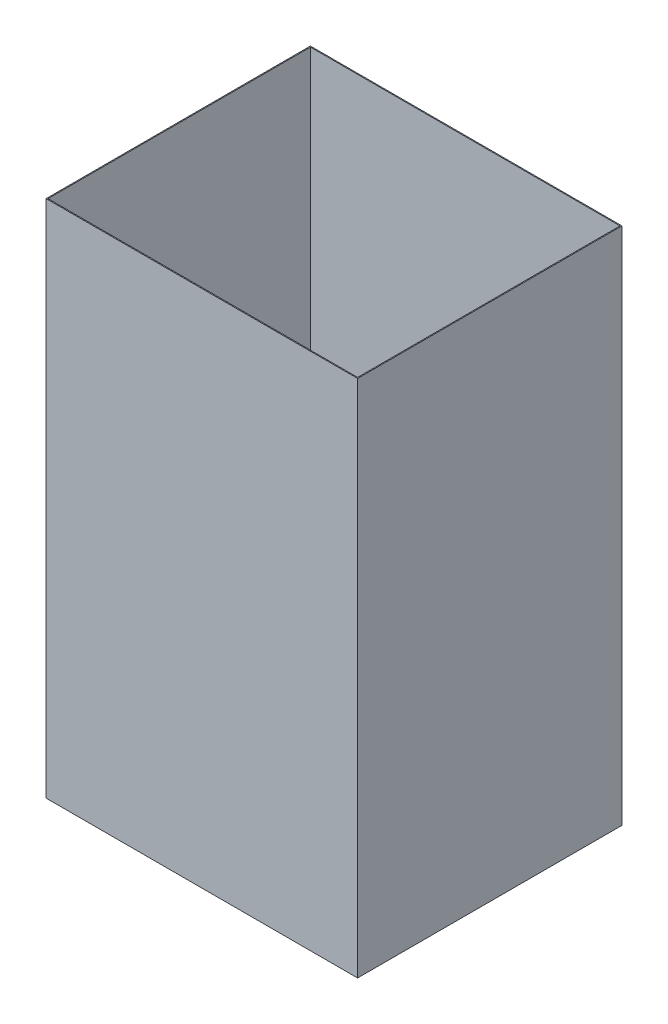
ISO-10303-21;
HEADER;
FILE_DESCRIPTION(('STEP AP214'),'2;1');
FILE_NAME('part.step','',(''),(''),'','','');
FILE_SCHEMA(('AUTOMOTIVE_DESIGN { 1 0 10303 214 1 1 1 1 }'));
ENDSEC;
DATA;
#1=APPLICATION_CONTEXT('core data for automotive mechanical design processes');
#2=APPLICATION_PROTOCOL_DEFINITION('international standard','automotive_design',2000,#1);
#3=PRODUCT_CONTEXT('',#1,'mechanical');
#4=PRODUCT('Part','Part','',(#3));
#5=PRODUCT_RELATED_PRODUCT_CATEGORY('part','',(#4));
#6=PRODUCT_DEFINITION_FORMATION('','',#4);
#7=PRODUCT_DEFINITION_CONTEXT('part definition',#1,'design');
#8=PRODUCT_DEFINITION('design','',#6,#7);
#9=PRODUCT_DEFINITION_SHAPE('','',#8);
#10=(LENGTH_UNIT() NAMED_UNIT(*) SI_UNIT(.MILLI.,.METRE.));
#11=(NAMED_UNIT(*) PLANE_ANGLE_UNIT() SI_UNIT($,.RADIAN.));
#12=(NAMED_UNIT(*) SI_UNIT($,.STERADIAN.) SOLID_ANGLE_UNIT());
#13=UNCERTAINTY_MEASURE_WITH_UNIT(LENGTH_MEASURE(1.E-05),#10,'distance_accuracy_value','');
#14=(GEOMETRIC_REPRESENTATION_CONTEXT(3) GLOBAL_UNCERTAINTY_ASSIGNED_CONTEXT((#13)) GLOBAL_UNIT_ASSIGNED_CONTEXT((#10,
#11,#12)) REPRESENTATION_CONTEXT('',''));
#15=CARTESIAN_POINT('',(0.,0.,0.));
#16=DIRECTION('',(0.,0.,1.));
#17=DIRECTION('',(1.,0.,0.));
#18=AXIS2_PLACEMENT_3D('',#15,#16,#17);
#19=CARTESIAN_POINT('',(0.,0.,0.));
#20=DIRECTION('',(0.,-1.,0.));
#21=DIRECTION('',(0.,0.,-1.));
#22=AXIS2_PLACEMENT_3D('',#19,#20,#21);
#23=PLANE('',#22);
#24=DIRECTION('',(0.,0.,1.));
#25=VECTOR('',#24,1.);
#26=CARTESIAN_POINT('',(0.,0.,0.));
#27=LINE('',#26,#25);
#28=CARTESIAN_POINT('',(0.,0.,-711.2));
#29=VERTEX_POINT('',#28);
#30=CARTESIAN_POINT('',(0.,0.,0.));
#31=VERTEX_POINT('',#30);
#32=EDGE_CURVE('E106',#29,#31,#27,.T.);
#33=ORIENTED_EDGE('',*,*,#32,.F.);
#34=DIRECTION('',(-1.,0.,0.));
#35=VECTOR('',#34,1.);
#36=CARTESIAN_POINT('',(0.,0.,-711.2));
#37=LINE('',#36,#35);
#38=CARTESIAN_POINT('',(838.2,0.,-711.2));
#39=VERTEX_POINT('',#38);
#40=EDGE_CURVE('E139',#39,#29,#37,.T.);
#41=ORIENTED_EDGE('',*,*,#40,.F.);
#42=DIRECTION('',(0.,0.,-1.));
#43=VECTOR('',#42,1.);
#44=CARTESIAN_POINT('',(838.2,0.,0.));
#45=LINE('',#44,#43);
#46=CARTESIAN_POINT('',(838.2,0.,0.));
#47=VERTEX_POINT('',#46);
#48=EDGE_CURVE('E150',#47,#39,#45,.T.);
#49=ORIENTED_EDGE('',*,*,#48,.F.);
#50=DIRECTION('',(1.,0.,0.));
#51=VECTOR('',#50,1.);
#52=CARTESIAN_POINT('',(0.,0.,0.));
#53=LINE('',#52,#51);
#54=EDGE_CURVE('E148',#31,#47,#53,.T.);
#55=ORIENTED_EDGE('',*,*,#54,.F.);
#56=EDGE_LOOP('',(#33,#41,#49,#55));
#57=FACE_BOUND('',#56,.T.);
#58=DIRECTION('',(-1.,0.,0.));
#59=VECTOR('',#58,1.);
#60=CARTESIAN_POINT('',(0.,0.,-708.66));
#61=LINE('',#60,#59);
#62=CARTESIAN_POINT('',(835.66,0.,-708.66));
#63=VERTEX_POINT('',#62);
#64=CARTESIAN_POINT('',(2.54,0.,-708.66));
#65=VERTEX_POINT('',#64);
#66=EDGE_CURVE('E127',#63,#65,#61,.T.);
#67=ORIENTED_EDGE('',*,*,#66,.T.);
#68=DIRECTION('',(0.,0.,1.));
#69=VECTOR('',#68,1.);
#70=CARTESIAN_POINT('',(2.54,0.,0.));
#71=LINE('',#70,#69);
#72=CARTESIAN_POINT('',(2.54,0.,-2.54));
#73=VERTEX_POINT('',#72);
#74=EDGE_CURVE('E114',#65,#73,#71,.T.);
#75=ORIENTED_EDGE('',*,*,#74,.T.);
#76=DIRECTION('',(1.,0.,0.));
#77=VECTOR('',#76,1.);
#78=CARTESIAN_POINT('',(0.,0.,-2.54));
#79=LINE('',#78,#77);
#80=CARTESIAN_POINT('',(835.66,0.,-2.54));
#81=VERTEX_POINT('',#80);
#82=EDGE_CURVE('E104',#73,#81,#79,.T.);
#83=ORIENTED_EDGE('',*,*,#82,.T.);
#84=DIRECTION('',(0.,0.,-1.));
#85=VECTOR('',#84,1.);
#86=CARTESIAN_POINT('',(835.66,0.,0.));
#87=LINE('',#86,#85);
#88=EDGE_CURVE('E55',#81,#63,#87,.T.);
#89=ORIENTED_EDGE('',*,*,#88,.T.);
#90=EDGE_LOOP('',(#67,#75,#83,#89));
#91=FACE_BOUND('',#90,.T.);
#92=ADVANCED_FACE('F32',(#57,#91),#23,.T.);
#93=CARTESIAN_POINT('',(0.,1397.,0.));
#94=DIRECTION('',(1.,0.,0.));
#95=DIRECTION('',(0.,0.,-1.));
#96=AXIS2_PLACEMENT_3D('',#93,#94,#95);
#97=PLANE('',#96);
#98=ORIENTED_EDGE('',*,*,#32,.T.);
#99=DIRECTION('',(0.,-1.,0.));
#100=VECTOR('',#99,1.);
#101=CARTESIAN_POINT('',(0.,1397.,0.));
#102=LINE('',#101,#100);
#103=CARTESIAN_POINT('',(0.,1397.,0.));
#104=VERTEX_POINT('',#103);
#105=EDGE_CURVE('E11',#104,#31,#102,.T.);
#106=ORIENTED_EDGE('',*,*,#105,.F.);
#107=DIRECTION('',(0.,0.,1.));
#108=VECTOR('',#107,1.);
#109=CARTESIAN_POINT('',(0.,1397.,0.));
#110=LINE('',#109,#108);
#111=CARTESIAN_POINT('',(0.,1397.,-711.2));
#112=VERTEX_POINT('',#111);
#113=EDGE_CURVE('E135',#112,#104,#110,.T.);
#114=ORIENTED_EDGE('',*,*,#113,.F.);
#115=DIRECTION('',(0.,-1.,0.));
#116=VECTOR('',#115,1.);
#117=CARTESIAN_POINT('',(0.,1397.,-711.2));
#118=LINE('',#117,#116);
#119=EDGE_CURVE('E145',#112,#29,#118,.T.);
#120=ORIENTED_EDGE('',*,*,#119,.T.);
#121=EDGE_LOOP('',(#98,#106,#114,#120));
#122=FACE_BOUND('',#121,.T.);
#123=ADVANCED_FACE('F34',(#122),#97,.F.);
#124=CARTESIAN_POINT('',(0.,1397.,0.));
#125=DIRECTION('',(0.,0.,-1.));
#126=DIRECTION('',(-1.,0.,0.));
#127=AXIS2_PLACEMENT_3D('',#124,#125,#126);
#128=PLANE('',#127);
#129=ORIENTED_EDGE('',*,*,#54,.T.);
#130=DIRECTION('',(0.,-1.,0.));
#131=VECTOR('',#130,1.);
#132=CARTESIAN_POINT('',(838.2,1397.,0.));
#133=LINE('',#132,#131);
#134=CARTESIAN_POINT('',(838.2,1397.,0.));
#135=VERTEX_POINT('',#134);
#136=EDGE_CURVE('E40',#135,#47,#133,.T.);
#137=ORIENTED_EDGE('',*,*,#136,.F.);
#138=DIRECTION('',(1.,0.,0.));
#139=VECTOR('',#138,1.);
#140=CARTESIAN_POINT('',(0.,1397.,0.));
#141=LINE('',#140,#139);
#142=EDGE_CURVE('E138',#104,#135,#141,.T.);
#143=ORIENTED_EDGE('',*,*,#142,.F.);
#144=ORIENTED_EDGE('',*,*,#105,.T.);
#145=EDGE_LOOP('',(#129,#137,#143,#144));
#146=FACE_BOUND('',#145,.T.);
#147=ADVANCED_FACE('F176',(#146),#128,.F.);
#148=CARTESIAN_POINT('',(838.2,1397.,0.));
#149=DIRECTION('',(-1.,0.,0.));
#150=DIRECTION('',(0.,0.,1.));
#151=AXIS2_PLACEMENT_3D('',#148,#149,#150);
#152=PLANE('',#151);
#153=ORIENTED_EDGE('',*,*,#48,.T.);
#154=DIRECTION('',(0.,-1.,0.));
#155=VECTOR('',#154,1.);
#156=CARTESIAN_POINT('',(838.2,1397.,-711.2));
#157=LINE('',#156,#155);
#158=CARTESIAN_POINT('',(838.2,1397.,-711.2));
#159=VERTEX_POINT('',#158);
#160=EDGE_CURVE('E155',#159,#39,#157,.T.);
#161=ORIENTED_EDGE('',*,*,#160,.F.);
#162=DIRECTION('',(0.,0.,-1.));
#163=VECTOR('',#162,1.);
#164=CARTESIAN_POINT('',(838.2,1397.,0.));
#165=LINE('',#164,#163);
#166=EDGE_CURVE('E141',#135,#159,#165,.T.);
#167=ORIENTED_EDGE('',*,*,#166,.F.);
#168=ORIENTED_EDGE('',*,*,#136,.T.);
#169=EDGE_LOOP('',(#153,#161,#167,#168));
#170=FACE_BOUND('',#169,.T.);
#171=ADVANCED_FACE('F162',(#170),#152,.F.);
#172=CARTESIAN_POINT('',(0.,1397.,-711.2));
#173=DIRECTION('',(0.,0.,1.));
#174=DIRECTION('',(1.,0.,0.));
#175=AXIS2_PLACEMENT_3D('',#172,#173,#174);
#176=PLANE('',#175);
#177=ORIENTED_EDGE('',*,*,#40,.T.);
#178=ORIENTED_EDGE('',*,*,#119,.F.);
#179=DIRECTION('',(-1.,0.,0.));
#180=VECTOR('',#179,1.);
#181=CARTESIAN_POINT('',(0.,1397.,-711.2));
#182=LINE('',#181,#180);
#183=EDGE_CURVE('E143',#159,#112,#182,.T.);
#184=ORIENTED_EDGE('',*,*,#183,.F.);
#185=ORIENTED_EDGE('',*,*,#160,.T.);
#186=EDGE_LOOP('',(#177,#178,#184,#185));
#187=FACE_BOUND('',#186,.T.);
#188=ADVANCED_FACE('F171',(#187),#176,.F.);
#189=CARTESIAN_POINT('',(0.,1397.,0.));
#190=DIRECTION('',(0.,-1.,0.));
#191=DIRECTION('',(0.,0.,-1.));
#192=AXIS2_PLACEMENT_3D('',#189,#190,#191);
#193=PLANE('',#192);
#194=DIRECTION('',(0.,0.,-1.));
#195=VECTOR('',#194,1.);
#196=CARTESIAN_POINT('',(835.66,1397.,-708.66));
#197=LINE('',#196,#195);
#198=CARTESIAN_POINT('',(835.66,1397.,-2.54));
#199=VERTEX_POINT('',#198);
#200=CARTESIAN_POINT('',(835.66,1397.,-708.66));
#201=VERTEX_POINT('',#200);
#202=EDGE_CURVE('E119',#199,#201,#197,.T.);
#203=ORIENTED_EDGE('',*,*,#202,.F.);
#204=DIRECTION('',(1.,0.,0.));
#205=VECTOR('',#204,1.);
#206=CARTESIAN_POINT('',(835.66,1397.,-2.54));
#207=LINE('',#206,#205);
#208=CARTESIAN_POINT('',(2.54,1397.,-2.54));
#209=VERTEX_POINT('',#208);
#210=EDGE_CURVE('E101',#209,#199,#207,.T.);
#211=ORIENTED_EDGE('',*,*,#210,.F.);
#212=DIRECTION('',(0.,0.,1.));
#213=VECTOR('',#212,1.);
#214=CARTESIAN_POINT('',(2.54,1397.,-2.54));
#215=LINE('',#214,#213);
#216=CARTESIAN_POINT('',(2.54,1397.,-708.66));
#217=VERTEX_POINT('',#216);
#218=EDGE_CURVE('E110',#217,#209,#215,.T.);
#219=ORIENTED_EDGE('',*,*,#218,.F.);
#220=DIRECTION('',(-1.,0.,0.));
#221=VECTOR('',#220,1.);
#222=CARTESIAN_POINT('',(2.54,1397.,-708.66));
#223=LINE('',#222,#221);
#224=EDGE_CURVE('E121',#201,#217,#223,.T.);
#225=ORIENTED_EDGE('',*,*,#224,.F.);
#226=EDGE_LOOP('',(#203,#211,#219,#225));
#227=FACE_BOUND('',#226,.T.);
#228=ORIENTED_EDGE('',*,*,#113,.T.);
#229=ORIENTED_EDGE('',*,*,#142,.T.);
#230=ORIENTED_EDGE('',*,*,#166,.T.);
#231=ORIENTED_EDGE('',*,*,#183,.T.);
#232=EDGE_LOOP('',(#228,#229,#230,#231));
#233=FACE_BOUND('',#232,.T.);
#234=ADVANCED_FACE('F116',(#227,#233),#193,.F.);
#235=CARTESIAN_POINT('',(2.54,1397.,0.));
#236=DIRECTION('',(1.,0.,0.));
#237=DIRECTION('',(0.,0.,-1.));
#238=AXIS2_PLACEMENT_3D('',#235,#236,#237);
#239=PLANE('',#238);
#240=ORIENTED_EDGE('',*,*,#74,.F.);
#241=DIRECTION('',(0.,-1.,0.));
#242=VECTOR('',#241,1.);
#243=CARTESIAN_POINT('',(2.54,1397.,-708.66));
#244=LINE('',#243,#242);
#245=EDGE_CURVE('E47',#217,#65,#244,.T.);
#246=ORIENTED_EDGE('',*,*,#245,.F.);
#247=ORIENTED_EDGE('',*,*,#218,.T.);
#248=DIRECTION('',(0.,-1.,0.));
#249=VECTOR('',#248,1.);
#250=CARTESIAN_POINT('',(2.54,1397.,-2.54));
#251=LINE('',#250,#249);
#252=EDGE_CURVE('E98',#209,#73,#251,.T.);
#253=ORIENTED_EDGE('',*,*,#252,.T.);
#254=EDGE_LOOP('',(#240,#246,#247,#253));
#255=FACE_BOUND('',#254,.T.);
#256=ADVANCED_FACE('F111',(#255),#239,.T.);
#257=CARTESIAN_POINT('',(0.,1397.,-2.54));
#258=DIRECTION('',(0.,0.,-1.));
#259=DIRECTION('',(-1.,0.,0.));
#260=AXIS2_PLACEMENT_3D('',#257,#258,#259);
#261=PLANE('',#260);
#262=ORIENTED_EDGE('',*,*,#82,.F.);
#263=ORIENTED_EDGE('',*,*,#252,.F.);
#264=ORIENTED_EDGE('',*,*,#210,.T.);
#265=DIRECTION('',(0.,-1.,0.));
#266=VECTOR('',#265,1.);
#267=CARTESIAN_POINT('',(835.66,1397.,-2.54));
#268=LINE('',#267,#266);
#269=EDGE_CURVE('E107',#199,#81,#268,.T.);
#270=ORIENTED_EDGE('',*,*,#269,.T.);
#271=EDGE_LOOP('',(#262,#263,#264,#270));
#272=FACE_BOUND('',#271,.T.);
#273=ADVANCED_FACE('F99',(#272),#261,.T.);
#274=CARTESIAN_POINT('',(835.66,1397.,0.));
#275=DIRECTION('',(-1.,0.,0.));
#276=DIRECTION('',(0.,0.,1.));
#277=AXIS2_PLACEMENT_3D('',#274,#275,#276);
#278=PLANE('',#277);
#279=ORIENTED_EDGE('',*,*,#88,.F.);
#280=ORIENTED_EDGE('',*,*,#269,.F.);
#281=ORIENTED_EDGE('',*,*,#202,.T.);
#282=DIRECTION('',(0.,-1.,0.));
#283=VECTOR('',#282,1.);
#284=CARTESIAN_POINT('',(835.66,1397.,-708.66));
#285=LINE('',#284,#283);
#286=EDGE_CURVE('E126',#201,#63,#285,.T.);
#287=ORIENTED_EDGE('',*,*,#286,.T.);
#288=EDGE_LOOP('',(#279,#280,#281,#287));
#289=FACE_BOUND('',#288,.T.);
#290=ADVANCED_FACE('F201',(#289),#278,.T.);
#291=CARTESIAN_POINT('',(0.,1397.,-708.66));
#292=DIRECTION('',(0.,0.,1.));
#293=DIRECTION('',(1.,0.,0.));
#294=AXIS2_PLACEMENT_3D('',#291,#292,#293);
#295=PLANE('',#294);
#296=ORIENTED_EDGE('',*,*,#66,.F.);
#297=ORIENTED_EDGE('',*,*,#286,.F.);
#298=ORIENTED_EDGE('',*,*,#224,.T.);
#299=ORIENTED_EDGE('',*,*,#245,.T.);
#300=EDGE_LOOP('',(#296,#297,#298,#299));
#301=FACE_BOUND('',#300,.T.);
#302=ADVANCED_FACE('F205',(#301),#295,.T.);
#303=CLOSED_SHELL('',(#92,#123,#147,#171,#188,#234,#256,#273,#290,#302));
#304=MANIFOLD_SOLID_BREP('B2',#303);
#305=ADVANCED_BREP_SHAPE_REPRESENTATION('',(#18,#304),#14);
#306=SHAPE_DEFINITION_REPRESENTATION(#9,#305);
ENDSEC;
END-ISO-10303-21;
